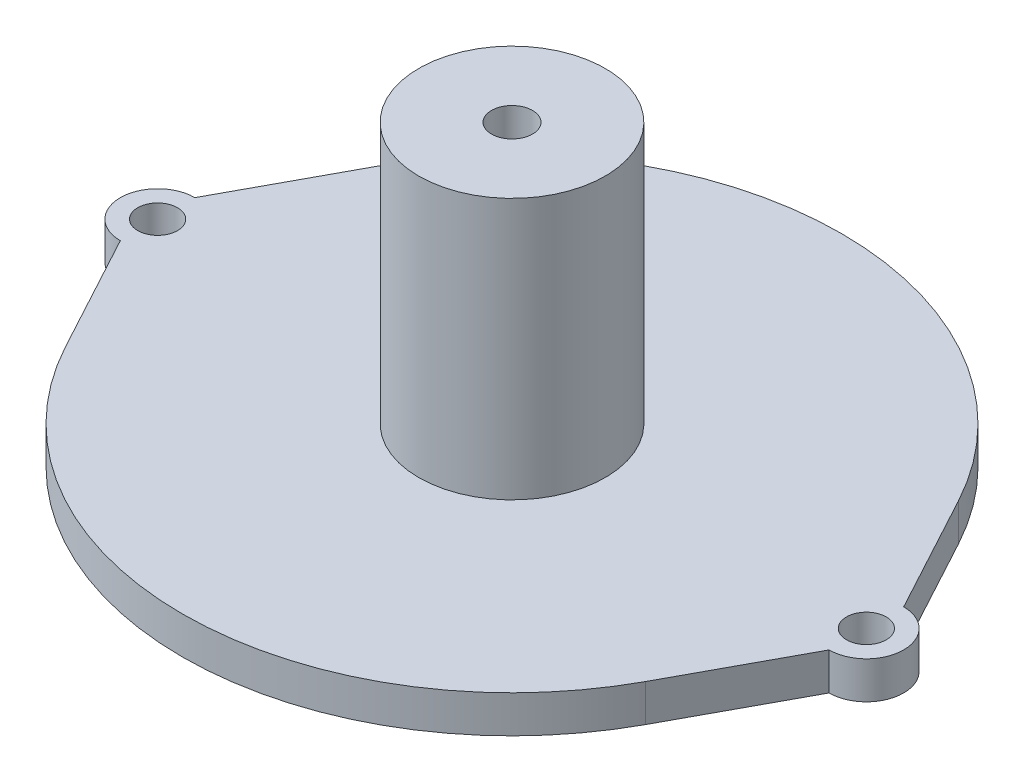
ISO-10303-21;
HEADER;
FILE_DESCRIPTION(('STEP AP214'),'2;1');
FILE_NAME('part.step','',(''),(''),'','','');
FILE_SCHEMA(('AUTOMOTIVE_DESIGN { 1 0 10303 214 1 1 1 1 }'));
ENDSEC;
DATA;
#1=APPLICATION_CONTEXT('core data for automotive mechanical design processes');
#2=APPLICATION_PROTOCOL_DEFINITION('international standard','automotive_design',2000,#1);
#3=PRODUCT_CONTEXT('',#1,'mechanical');
#4=PRODUCT('Part','Part','',(#3));
#5=PRODUCT_RELATED_PRODUCT_CATEGORY('part','',(#4));
#6=PRODUCT_DEFINITION_FORMATION('','',#4);
#7=PRODUCT_DEFINITION_CONTEXT('part definition',#1,'design');
#8=PRODUCT_DEFINITION('design','',#6,#7);
#9=PRODUCT_DEFINITION_SHAPE('','',#8);
#10=(LENGTH_UNIT() NAMED_UNIT(*) SI_UNIT(.MILLI.,.METRE.));
#11=(NAMED_UNIT(*) PLANE_ANGLE_UNIT() SI_UNIT($,.RADIAN.));
#12=(NAMED_UNIT(*) SI_UNIT($,.STERADIAN.) SOLID_ANGLE_UNIT());
#13=UNCERTAINTY_MEASURE_WITH_UNIT(LENGTH_MEASURE(1.E-05),#10,'distance_accuracy_value','');
#14=(GEOMETRIC_REPRESENTATION_CONTEXT(3) GLOBAL_UNCERTAINTY_ASSIGNED_CONTEXT((#13)) GLOBAL_UNIT_ASSIGNED_CONTEXT((#10,
#11,#12)) REPRESENTATION_CONTEXT('',''));
#15=CARTESIAN_POINT('',(0.,0.,0.));
#16=DIRECTION('',(0.,0.,1.));
#17=DIRECTION('',(1.,0.,0.));
#18=AXIS2_PLACEMENT_3D('',#15,#16,#17);
#19=CARTESIAN_POINT('',(-28.5,-3.,0.));
#20=DIRECTION('',(0.,1.,0.));
#21=DIRECTION('',(0.,0.,1.));
#22=AXIS2_PLACEMENT_3D('',#19,#20,#21);
#23=PLANE('',#22);
#24=CARTESIAN_POINT('',(0.,-3.,0.));
#25=DIRECTION('',(0.,1.,0.));
#26=DIRECTION('',(0.,0.,1.));
#27=AXIS2_PLACEMENT_3D('',#24,#25,#26);
#28=CIRCLE('',#27,1.65);
#29=CARTESIAN_POINT('',(0.,-3.,1.65));
#30=VERTEX_POINT('',#29);
#31=EDGE_CURVE('E305',#30,#30,#28,.T.);
#32=ORIENTED_EDGE('',*,*,#31,.T.);
#33=EDGE_LOOP('',(#32));
#34=FACE_BOUND('',#33,.T.);
#35=CARTESIAN_POINT('',(-28.5,-3.,0.));
#36=DIRECTION('',(0.,-1.,0.));
#37=DIRECTION('',(0.,0.,-1.));
#38=AXIS2_PLACEMENT_3D('',#35,#36,#37);
#39=CIRCLE('',#38,1.6);
#40=CARTESIAN_POINT('',(-28.5,-3.,-1.6));
#41=VERTEX_POINT('',#40);
#42=EDGE_CURVE('E211',#41,#41,#39,.T.);
#43=ORIENTED_EDGE('',*,*,#42,.F.);
#44=EDGE_LOOP('',(#43));
#45=FACE_BOUND('',#44,.T.);
#46=CARTESIAN_POINT('',(-28.5,-3.,0.));
#47=DIRECTION('',(0.,1.,0.));
#48=DIRECTION('',(0.,0.,1.));
#49=AXIS2_PLACEMENT_3D('',#46,#47,#48);
#50=CIRCLE('',#49,3.);
#51=CARTESIAN_POINT('',(-28.5,-3.,-3.));
#52=VERTEX_POINT('',#51);
#53=CARTESIAN_POINT('',(-28.5,-3.,3.));
#54=VERTEX_POINT('',#53);
#55=EDGE_CURVE('E156',#52,#54,#50,.T.);
#56=ORIENTED_EDGE('',*,*,#55,.F.);
#57=DIRECTION('',(-0.475370831375486,0.,0.879785526521879));
#58=VECTOR('',#57,1.);
#59=CARTESIAN_POINT('',(-28.5,-3.,-3.));
#60=LINE('',#59,#58);
#61=CARTESIAN_POINT('',(-23.3143164528298,-3.,-12.5973270314504));
#62=VERTEX_POINT('',#61);
#63=EDGE_CURVE('E125',#62,#52,#60,.T.);
#64=ORIENTED_EDGE('',*,*,#63,.F.);
#65=CARTESIAN_POINT('',(0.,-3.,0.));
#66=DIRECTION('',(0.,1.,0.));
#67=DIRECTION('',(0.,0.,1.));
#68=AXIS2_PLACEMENT_3D('',#65,#66,#67);
#69=CIRCLE('',#68,26.5);
#70=CARTESIAN_POINT('',(23.3143164528298,-3.,-12.5973270314504));
#71=VERTEX_POINT('',#70);
#72=EDGE_CURVE('E110',#71,#62,#69,.T.);
#73=ORIENTED_EDGE('',*,*,#72,.F.);
#74=DIRECTION('',(-0.475370831375486,0.,-0.879785526521879));
#75=VECTOR('',#74,1.);
#76=CARTESIAN_POINT('',(28.5,-3.,-3.));
#77=LINE('',#76,#75);
#78=CARTESIAN_POINT('',(28.5,-3.,-3.));
#79=VERTEX_POINT('',#78);
#80=EDGE_CURVE('E123',#79,#71,#77,.T.);
#81=ORIENTED_EDGE('',*,*,#80,.F.);
#82=CARTESIAN_POINT('',(28.5,-3.,0.));
#83=DIRECTION('',(0.,1.,0.));
#84=DIRECTION('',(0.,0.,1.));
#85=AXIS2_PLACEMENT_3D('',#82,#83,#84);
#86=CIRCLE('',#85,3.);
#87=CARTESIAN_POINT('',(28.5,-3.,3.));
#88=VERTEX_POINT('',#87);
#89=EDGE_CURVE('E128',#88,#79,#86,.T.);
#90=ORIENTED_EDGE('',*,*,#89,.F.);
#91=DIRECTION('',(0.475370831375486,0.,-0.879785526521879));
#92=VECTOR('',#91,1.);
#93=CARTESIAN_POINT('',(28.5,-3.,3.));
#94=LINE('',#93,#92);
#95=CARTESIAN_POINT('',(23.3143164528298,-3.,12.5973270314504));
#96=VERTEX_POINT('',#95);
#97=EDGE_CURVE('E130',#96,#88,#94,.T.);
#98=ORIENTED_EDGE('',*,*,#97,.F.);
#99=CARTESIAN_POINT('',(0.,-3.,0.));
#100=DIRECTION('',(0.,1.,0.));
#101=DIRECTION('',(0.,0.,1.));
#102=AXIS2_PLACEMENT_3D('',#99,#100,#101);
#103=CIRCLE('',#102,26.5);
#104=CARTESIAN_POINT('',(-23.3143164528298,-3.,12.5973270314504));
#105=VERTEX_POINT('',#104);
#106=EDGE_CURVE('E217',#105,#96,#103,.T.);
#107=ORIENTED_EDGE('',*,*,#106,.F.);
#108=DIRECTION('',(0.475370831375486,0.,0.879785526521879));
#109=VECTOR('',#108,1.);
#110=CARTESIAN_POINT('',(-28.5,-3.,3.));
#111=LINE('',#110,#109);
#112=EDGE_CURVE('E215',#54,#105,#111,.T.);
#113=ORIENTED_EDGE('',*,*,#112,.F.);
#114=EDGE_LOOP('',(#56,#64,#73,#81,#90,#98,#107,#113));
#115=FACE_BOUND('',#114,.T.);
#116=CARTESIAN_POINT('',(28.5,-3.,0.));
#117=DIRECTION('',(0.,-1.,0.));
#118=DIRECTION('',(0.,0.,-1.));
#119=AXIS2_PLACEMENT_3D('',#116,#117,#118);
#120=CIRCLE('',#119,1.6);
#121=CARTESIAN_POINT('',(28.5,-3.,-1.6));
#122=VERTEX_POINT('',#121);
#123=EDGE_CURVE('E310',#122,#122,#120,.T.);
#124=ORIENTED_EDGE('',*,*,#123,.F.);
#125=EDGE_LOOP('',(#124));
#126=FACE_BOUND('',#125,.T.);
#127=ADVANCED_FACE('F37',(#34,#45,#115,#126),#23,.F.);
#128=CARTESIAN_POINT('',(-28.5,-3.,0.));
#129=DIRECTION('',(0.,1.,0.));
#130=DIRECTION('',(0.,0.,1.));
#131=AXIS2_PLACEMENT_3D('',#128,#129,#130);
#132=CYLINDRICAL_SURFACE('',#131,3.);
#133=CARTESIAN_POINT('',(-28.5,0.,0.));
#134=DIRECTION('',(0.,1.,0.));
#135=DIRECTION('',(0.,0.,1.));
#136=AXIS2_PLACEMENT_3D('',#133,#134,#135);
#137=CIRCLE('',#136,3.);
#138=CARTESIAN_POINT('',(-28.5,0.,-3.));
#139=VERTEX_POINT('',#138);
#140=CARTESIAN_POINT('',(-28.5,0.,3.));
#141=VERTEX_POINT('',#140);
#142=EDGE_CURVE('E135',#139,#141,#137,.T.);
#143=ORIENTED_EDGE('',*,*,#142,.F.);
#144=DIRECTION('',(0.,1.,0.));
#145=VECTOR('',#144,1.);
#146=CARTESIAN_POINT('',(-28.5,-3.,-3.));
#147=LINE('',#146,#145);
#148=EDGE_CURVE('E11',#52,#139,#147,.T.);
#149=ORIENTED_EDGE('',*,*,#148,.F.);
#150=ORIENTED_EDGE('',*,*,#55,.T.);
#151=DIRECTION('',(0.,1.,0.));
#152=VECTOR('',#151,1.);
#153=CARTESIAN_POINT('',(-28.5,-3.,3.));
#154=LINE('',#153,#152);
#155=EDGE_CURVE('E41',#54,#141,#154,.T.);
#156=ORIENTED_EDGE('',*,*,#155,.T.);
#157=EDGE_LOOP('',(#143,#149,#150,#156));
#158=FACE_BOUND('',#157,.T.);
#159=ADVANCED_FACE('F39',(#158),#132,.T.);
#160=CARTESIAN_POINT('',(-28.5,-3.,-3.));
#161=DIRECTION('',(-0.879785526521879,0.,-0.475370831375486));
#162=DIRECTION('',(-0.475370831375486,0.,0.879785526521879));
#163=AXIS2_PLACEMENT_3D('',#160,#161,#162);
#164=PLANE('',#163);
#165=DIRECTION('',(-0.475370831375486,0.,0.879785526521879));
#166=VECTOR('',#165,1.);
#167=CARTESIAN_POINT('',(-28.5,0.,-3.));
#168=LINE('',#167,#166);
#169=CARTESIAN_POINT('',(-23.3143164528298,0.,-12.5973270314504));
#170=VERTEX_POINT('',#169);
#171=EDGE_CURVE('E154',#170,#139,#168,.T.);
#172=ORIENTED_EDGE('',*,*,#171,.F.);
#173=DIRECTION('',(0.,1.,0.));
#174=VECTOR('',#173,1.);
#175=CARTESIAN_POINT('',(-23.3143164528298,-3.,-12.5973270314504));
#176=LINE('',#175,#174);
#177=EDGE_CURVE('E47',#62,#170,#176,.T.);
#178=ORIENTED_EDGE('',*,*,#177,.F.);
#179=ORIENTED_EDGE('',*,*,#63,.T.);
#180=ORIENTED_EDGE('',*,*,#148,.T.);
#181=EDGE_LOOP('',(#172,#178,#179,#180));
#182=FACE_BOUND('',#181,.T.);
#183=ADVANCED_FACE('F168',(#182),#164,.T.);
#184=CARTESIAN_POINT('',(0.,-3.,0.));
#185=DIRECTION('',(0.,1.,0.));
#186=DIRECTION('',(0.,0.,1.));
#187=AXIS2_PLACEMENT_3D('',#184,#185,#186);
#188=CYLINDRICAL_SURFACE('',#187,26.5);
#189=CARTESIAN_POINT('',(0.,0.,0.));
#190=DIRECTION('',(0.,1.,0.));
#191=DIRECTION('',(0.,0.,1.));
#192=AXIS2_PLACEMENT_3D('',#189,#190,#191);
#193=CIRCLE('',#192,26.5);
#194=CARTESIAN_POINT('',(23.3143164528298,0.,-12.5973270314504));
#195=VERTEX_POINT('',#194);
#196=EDGE_CURVE('E112',#195,#170,#193,.T.);
#197=ORIENTED_EDGE('',*,*,#196,.F.);
#198=DIRECTION('',(0.,1.,0.));
#199=VECTOR('',#198,1.);
#200=CARTESIAN_POINT('',(23.3143164528298,-3.,-12.5973270314504));
#201=LINE('',#200,#199);
#202=EDGE_CURVE('E107',#71,#195,#201,.T.);
#203=ORIENTED_EDGE('',*,*,#202,.F.);
#204=ORIENTED_EDGE('',*,*,#72,.T.);
#205=ORIENTED_EDGE('',*,*,#177,.T.);
#206=EDGE_LOOP('',(#197,#203,#204,#205));
#207=FACE_BOUND('',#206,.T.);
#208=ADVANCED_FACE('F109',(#207),#188,.T.);
#209=CARTESIAN_POINT('',(28.5,-3.,-3.));
#210=DIRECTION('',(0.879785526521879,0.,-0.475370831375486));
#211=DIRECTION('',(-0.475370831375486,0.,-0.879785526521879));
#212=AXIS2_PLACEMENT_3D('',#209,#210,#211);
#213=PLANE('',#212);
#214=DIRECTION('',(-0.475370831375486,0.,-0.879785526521879));
#215=VECTOR('',#214,1.);
#216=CARTESIAN_POINT('',(28.5,0.,-3.));
#217=LINE('',#216,#215);
#218=CARTESIAN_POINT('',(28.5,0.,-3.));
#219=VERTEX_POINT('',#218);
#220=EDGE_CURVE('E151',#219,#195,#217,.T.);
#221=ORIENTED_EDGE('',*,*,#220,.F.);
#222=DIRECTION('',(0.,1.,0.));
#223=VECTOR('',#222,1.);
#224=CARTESIAN_POINT('',(28.5,-3.,-3.));
#225=LINE('',#224,#223);
#226=EDGE_CURVE('E117',#79,#219,#225,.T.);
#227=ORIENTED_EDGE('',*,*,#226,.F.);
#228=ORIENTED_EDGE('',*,*,#80,.T.);
#229=ORIENTED_EDGE('',*,*,#202,.T.);
#230=EDGE_LOOP('',(#221,#227,#228,#229));
#231=FACE_BOUND('',#230,.T.);
#232=ADVANCED_FACE('F127',(#231),#213,.T.);
#233=CARTESIAN_POINT('',(28.5,-3.,0.));
#234=DIRECTION('',(0.,1.,0.));
#235=DIRECTION('',(0.,0.,1.));
#236=AXIS2_PLACEMENT_3D('',#233,#234,#235);
#237=CYLINDRICAL_SURFACE('',#236,3.);
#238=CARTESIAN_POINT('',(28.5,0.,0.));
#239=DIRECTION('',(0.,1.,0.));
#240=DIRECTION('',(0.,0.,1.));
#241=AXIS2_PLACEMENT_3D('',#238,#239,#240);
#242=CIRCLE('',#241,3.);
#243=CARTESIAN_POINT('',(28.5,0.,3.));
#244=VERTEX_POINT('',#243);
#245=EDGE_CURVE('E148',#244,#219,#242,.T.);
#246=ORIENTED_EDGE('',*,*,#245,.F.);
#247=DIRECTION('',(0.,1.,0.));
#248=VECTOR('',#247,1.);
#249=CARTESIAN_POINT('',(28.5,-3.,3.));
#250=LINE('',#249,#248);
#251=EDGE_CURVE('E160',#88,#244,#250,.T.);
#252=ORIENTED_EDGE('',*,*,#251,.F.);
#253=ORIENTED_EDGE('',*,*,#89,.T.);
#254=ORIENTED_EDGE('',*,*,#226,.T.);
#255=EDGE_LOOP('',(#246,#252,#253,#254));
#256=FACE_BOUND('',#255,.T.);
#257=ADVANCED_FACE('F228',(#256),#237,.T.);
#258=CARTESIAN_POINT('',(28.5,-3.,3.));
#259=DIRECTION('',(0.879785526521879,0.,0.475370831375486));
#260=DIRECTION('',(0.475370831375486,0.,-0.879785526521879));
#261=AXIS2_PLACEMENT_3D('',#258,#259,#260);
#262=PLANE('',#261);
#263=DIRECTION('',(0.475370831375486,0.,-0.879785526521879));
#264=VECTOR('',#263,1.);
#265=CARTESIAN_POINT('',(28.5,0.,3.));
#266=LINE('',#265,#264);
#267=CARTESIAN_POINT('',(23.3143164528298,0.,12.5973270314504));
#268=VERTEX_POINT('',#267);
#269=EDGE_CURVE('E145',#268,#244,#266,.T.);
#270=ORIENTED_EDGE('',*,*,#269,.F.);
#271=DIRECTION('',(0.,1.,0.));
#272=VECTOR('',#271,1.);
#273=CARTESIAN_POINT('',(23.3143164528298,-3.,12.5973270314504));
#274=LINE('',#273,#272);
#275=EDGE_CURVE('E162',#96,#268,#274,.T.);
#276=ORIENTED_EDGE('',*,*,#275,.F.);
#277=ORIENTED_EDGE('',*,*,#97,.T.);
#278=ORIENTED_EDGE('',*,*,#251,.T.);
#279=EDGE_LOOP('',(#270,#276,#277,#278));
#280=FACE_BOUND('',#279,.T.);
#281=ADVANCED_FACE('F223',(#280),#262,.T.);
#282=CARTESIAN_POINT('',(0.,-3.,0.));
#283=DIRECTION('',(0.,1.,0.));
#284=DIRECTION('',(0.,0.,1.));
#285=AXIS2_PLACEMENT_3D('',#282,#283,#284);
#286=CYLINDRICAL_SURFACE('',#285,26.5);
#287=CARTESIAN_POINT('',(0.,0.,0.));
#288=DIRECTION('',(0.,1.,0.));
#289=DIRECTION('',(0.,0.,1.));
#290=AXIS2_PLACEMENT_3D('',#287,#288,#289);
#291=CIRCLE('',#290,26.5);
#292=CARTESIAN_POINT('',(-23.3143164528298,0.,12.5973270314504));
#293=VERTEX_POINT('',#292);
#294=EDGE_CURVE('E142',#293,#268,#291,.T.);
#295=ORIENTED_EDGE('',*,*,#294,.F.);
#296=DIRECTION('',(0.,1.,0.));
#297=VECTOR('',#296,1.);
#298=CARTESIAN_POINT('',(-23.3143164528298,-3.,12.5973270314504));
#299=LINE('',#298,#297);
#300=EDGE_CURVE('E163',#105,#293,#299,.T.);
#301=ORIENTED_EDGE('',*,*,#300,.F.);
#302=ORIENTED_EDGE('',*,*,#106,.T.);
#303=ORIENTED_EDGE('',*,*,#275,.T.);
#304=EDGE_LOOP('',(#295,#301,#302,#303));
#305=FACE_BOUND('',#304,.T.);
#306=ADVANCED_FACE('F195',(#305),#286,.T.);
#307=CARTESIAN_POINT('',(-28.5,-3.,3.));
#308=DIRECTION('',(-0.879785526521879,0.,0.475370831375486));
#309=DIRECTION('',(0.475370831375486,0.,0.879785526521879));
#310=AXIS2_PLACEMENT_3D('',#307,#308,#309);
#311=PLANE('',#310);
#312=DIRECTION('',(0.475370831375486,0.,0.879785526521879));
#313=VECTOR('',#312,1.);
#314=CARTESIAN_POINT('',(-28.5,0.,3.));
#315=LINE('',#314,#313);
#316=EDGE_CURVE('E138',#141,#293,#315,.T.);
#317=ORIENTED_EDGE('',*,*,#316,.F.);
#318=ORIENTED_EDGE('',*,*,#155,.F.);
#319=ORIENTED_EDGE('',*,*,#112,.T.);
#320=ORIENTED_EDGE('',*,*,#300,.T.);
#321=EDGE_LOOP('',(#317,#318,#319,#320));
#322=FACE_BOUND('',#321,.T.);
#323=ADVANCED_FACE('F165',(#322),#311,.T.);
#324=CARTESIAN_POINT('',(-28.5,0.,0.));
#325=DIRECTION('',(0.,1.,0.));
#326=DIRECTION('',(0.,0.,1.));
#327=AXIS2_PLACEMENT_3D('',#324,#325,#326);
#328=PLANE('',#327);
#329=CARTESIAN_POINT('',(28.5,0.,0.));
#330=DIRECTION('',(0.,1.,0.));
#331=DIRECTION('',(0.,0.,1.));
#332=AXIS2_PLACEMENT_3D('',#329,#330,#331);
#333=CIRCLE('',#332,1.6);
#334=CARTESIAN_POINT('',(28.5,0.,1.6));
#335=VERTEX_POINT('',#334);
#336=EDGE_CURVE('E199',#335,#335,#333,.T.);
#337=ORIENTED_EDGE('',*,*,#336,.F.);
#338=EDGE_LOOP('',(#337));
#339=FACE_BOUND('',#338,.T.);
#340=CARTESIAN_POINT('',(-28.5,0.,0.));
#341=DIRECTION('',(0.,1.,0.));
#342=DIRECTION('',(0.,0.,1.));
#343=AXIS2_PLACEMENT_3D('',#340,#341,#342);
#344=CIRCLE('',#343,1.6);
#345=CARTESIAN_POINT('',(-28.5,0.,1.6));
#346=VERTEX_POINT('',#345);
#347=EDGE_CURVE('E203',#346,#346,#344,.T.);
#348=ORIENTED_EDGE('',*,*,#347,.F.);
#349=EDGE_LOOP('',(#348));
#350=FACE_BOUND('',#349,.T.);
#351=CARTESIAN_POINT('',(0.,0.,0.));
#352=DIRECTION('',(0.,1.,0.));
#353=DIRECTION('',(0.,0.,1.));
#354=AXIS2_PLACEMENT_3D('',#351,#352,#353);
#355=CIRCLE('',#354,7.5);
#356=CARTESIAN_POINT('',(0.,0.,7.5));
#357=VERTEX_POINT('',#356);
#358=EDGE_CURVE('E206',#357,#357,#355,.T.);
#359=ORIENTED_EDGE('',*,*,#358,.F.);
#360=EDGE_LOOP('',(#359));
#361=FACE_BOUND('',#360,.T.);
#362=ORIENTED_EDGE('',*,*,#142,.T.);
#363=ORIENTED_EDGE('',*,*,#316,.T.);
#364=ORIENTED_EDGE('',*,*,#294,.T.);
#365=ORIENTED_EDGE('',*,*,#269,.T.);
#366=ORIENTED_EDGE('',*,*,#245,.T.);
#367=ORIENTED_EDGE('',*,*,#220,.T.);
#368=ORIENTED_EDGE('',*,*,#196,.T.);
#369=ORIENTED_EDGE('',*,*,#171,.T.);
#370=EDGE_LOOP('',(#362,#363,#364,#365,#366,#367,#368,#369));
#371=FACE_BOUND('',#370,.T.);
#372=ADVANCED_FACE('F167',(#339,#350,#361,#371),#328,.T.);
#373=CARTESIAN_POINT('',(0.,21.,0.));
#374=DIRECTION('',(0.,-1.,0.));
#375=DIRECTION('',(0.,0.,-1.));
#376=AXIS2_PLACEMENT_3D('',#373,#374,#375);
#377=CYLINDRICAL_SURFACE('',#376,7.5);
#378=CARTESIAN_POINT('',(0.,21.,0.));
#379=DIRECTION('',(0.,1.,0.));
#380=DIRECTION('',(0.,0.,1.));
#381=AXIS2_PLACEMENT_3D('',#378,#379,#380);
#382=CIRCLE('',#381,7.5);
#383=CARTESIAN_POINT('',(0.,21.,7.5));
#384=VERTEX_POINT('',#383);
#385=EDGE_CURVE('E139',#384,#384,#382,.T.);
#386=ORIENTED_EDGE('',*,*,#385,.F.);
#387=EDGE_LOOP('',(#386));
#388=FACE_BOUND('',#387,.T.);
#389=ORIENTED_EDGE('',*,*,#358,.T.);
#390=EDGE_LOOP('',(#389));
#391=FACE_BOUND('',#390,.T.);
#392=ADVANCED_FACE('F185',(#388,#391),#377,.T.);
#393=CARTESIAN_POINT('',(0.,21.,0.));
#394=DIRECTION('',(0.,1.,0.));
#395=DIRECTION('',(0.,0.,1.));
#396=AXIS2_PLACEMENT_3D('',#393,#394,#395);
#397=PLANE('',#396);
#398=CARTESIAN_POINT('',(0.,21.,0.));
#399=DIRECTION('',(0.,1.,0.));
#400=DIRECTION('',(0.,0.,1.));
#401=AXIS2_PLACEMENT_3D('',#398,#399,#400);
#402=CIRCLE('',#401,1.65);
#403=CARTESIAN_POINT('',(0.,21.,1.65));
#404=VERTEX_POINT('',#403);
#405=EDGE_CURVE('E308',#404,#404,#402,.T.);
#406=ORIENTED_EDGE('',*,*,#405,.F.);
#407=EDGE_LOOP('',(#406));
#408=FACE_BOUND('',#407,.T.);
#409=ORIENTED_EDGE('',*,*,#385,.T.);
#410=EDGE_LOOP('',(#409));
#411=FACE_BOUND('',#410,.T.);
#412=ADVANCED_FACE('F193',(#408,#411),#397,.T.);
#413=CARTESIAN_POINT('',(-28.5,-3.,0.));
#414=DIRECTION('',(0.,-1.,0.));
#415=DIRECTION('',(0.,0.,-1.));
#416=AXIS2_PLACEMENT_3D('',#413,#414,#415);
#417=CYLINDRICAL_SURFACE('',#416,1.6);
#418=ORIENTED_EDGE('',*,*,#42,.T.);
#419=EDGE_LOOP('',(#418));
#420=FACE_BOUND('',#419,.T.);
#421=ORIENTED_EDGE('',*,*,#347,.T.);
#422=EDGE_LOOP('',(#421));
#423=FACE_BOUND('',#422,.T.);
#424=ADVANCED_FACE('F264',(#420,#423),#417,.F.);
#425=CARTESIAN_POINT('',(28.5,-3.,0.));
#426=DIRECTION('',(0.,-1.,0.));
#427=DIRECTION('',(0.,0.,-1.));
#428=AXIS2_PLACEMENT_3D('',#425,#426,#427);
#429=CYLINDRICAL_SURFACE('',#428,1.6);
#430=ORIENTED_EDGE('',*,*,#123,.T.);
#431=EDGE_LOOP('',(#430));
#432=FACE_BOUND('',#431,.T.);
#433=ORIENTED_EDGE('',*,*,#336,.T.);
#434=EDGE_LOOP('',(#433));
#435=FACE_BOUND('',#434,.T.);
#436=ADVANCED_FACE('F269',(#432,#435),#429,.F.);
#437=CARTESIAN_POINT('',(0.,-3.,0.));
#438=DIRECTION('',(0.,1.,0.));
#439=DIRECTION('',(0.,0.,1.));
#440=AXIS2_PLACEMENT_3D('',#437,#438,#439);
#441=CYLINDRICAL_SURFACE('',#440,1.65);
#442=ORIENTED_EDGE('',*,*,#31,.F.);
#443=EDGE_LOOP('',(#442));
#444=FACE_BOUND('',#443,.T.);
#445=ORIENTED_EDGE('',*,*,#405,.T.);
#446=EDGE_LOOP('',(#445));
#447=FACE_BOUND('',#446,.T.);
#448=ADVANCED_FACE('F279',(#444,#447),#441,.F.);
#449=CLOSED_SHELL('',(#127,#159,#183,#208,#232,#257,#281,#306,#323,#372,#392,#412,#424,#436,#448));
#450=MANIFOLD_SOLID_BREP('B2',#449);
#451=ADVANCED_BREP_SHAPE_REPRESENTATION('',(#18,#450),#14);
#452=SHAPE_DEFINITION_REPRESENTATION(#9,#451);
ENDSEC;
END-ISO-10303-21;
